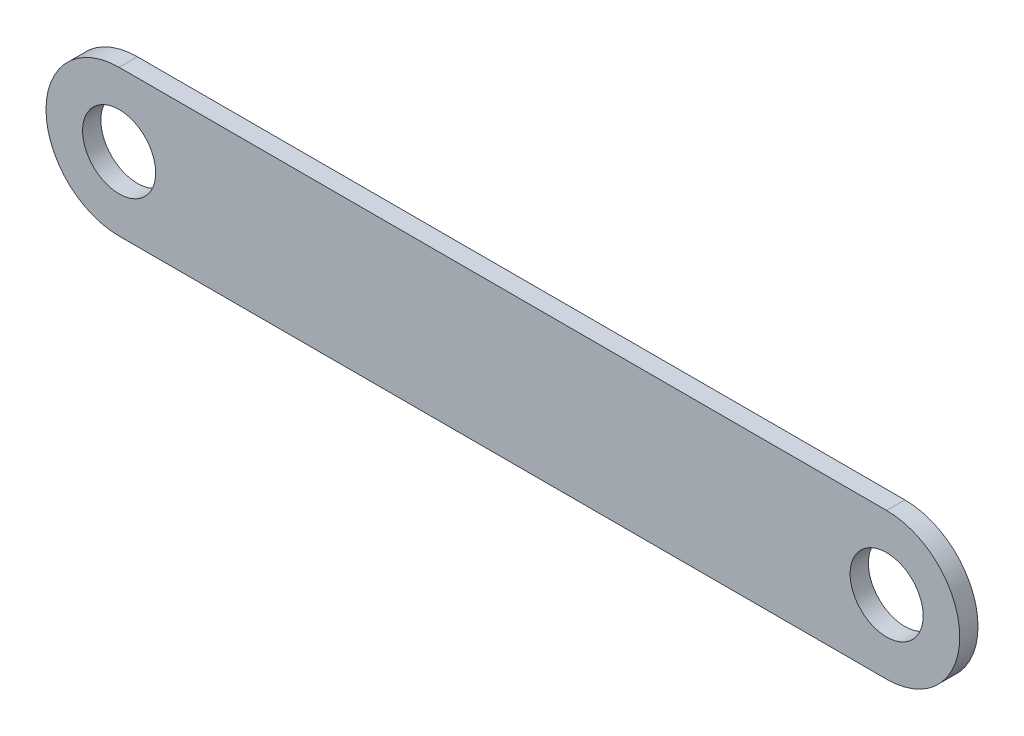
ISO-10303-21;
HEADER;
FILE_DESCRIPTION(('STEP AP214'),'2;1');
FILE_NAME('part.step','',(''),(''),'','','');
FILE_SCHEMA(('AUTOMOTIVE_DESIGN { 1 0 10303 214 1 1 1 1 }'));
ENDSEC;
DATA;
#1=APPLICATION_CONTEXT('core data for automotive mechanical design processes');
#2=APPLICATION_PROTOCOL_DEFINITION('international standard','automotive_design',2000,#1);
#3=PRODUCT_CONTEXT('',#1,'mechanical');
#4=PRODUCT('Part','Part','',(#3));
#5=PRODUCT_RELATED_PRODUCT_CATEGORY('part','',(#4));
#6=PRODUCT_DEFINITION_FORMATION('','',#4);
#7=PRODUCT_DEFINITION_CONTEXT('part definition',#1,'design');
#8=PRODUCT_DEFINITION('design','',#6,#7);
#9=PRODUCT_DEFINITION_SHAPE('','',#8);
#10=(LENGTH_UNIT() NAMED_UNIT(*) SI_UNIT(.MILLI.,.METRE.));
#11=(NAMED_UNIT(*) PLANE_ANGLE_UNIT() SI_UNIT($,.RADIAN.));
#12=(NAMED_UNIT(*) SI_UNIT($,.STERADIAN.) SOLID_ANGLE_UNIT());
#13=UNCERTAINTY_MEASURE_WITH_UNIT(LENGTH_MEASURE(1.E-05),#10,'distance_accuracy_value','');
#14=(GEOMETRIC_REPRESENTATION_CONTEXT(3) GLOBAL_UNCERTAINTY_ASSIGNED_CONTEXT((#13)) GLOBAL_UNIT_ASSIGNED_CONTEXT((#10,
#11,#12)) REPRESENTATION_CONTEXT('',''));
#15=CARTESIAN_POINT('',(0.,0.,0.));
#16=DIRECTION('',(0.,0.,1.));
#17=DIRECTION('',(1.,0.,0.));
#18=AXIS2_PLACEMENT_3D('',#15,#16,#17);
#19=CARTESIAN_POINT('',(51.5130500758725,1.55705614567526,5.));
#20=DIRECTION('',(0.,0.,-1.));
#21=DIRECTION('',(-1.,0.,0.));
#22=AXIS2_PLACEMENT_3D('',#19,#20,#21);
#23=CYLINDRICAL_SURFACE('',#22,20.);
#24=CARTESIAN_POINT('',(51.5130500758725,1.55705614567526,0.));
#25=DIRECTION('',(0.,0.,1.));
#26=DIRECTION('',(1.,0.,0.));
#27=AXIS2_PLACEMENT_3D('',#24,#25,#26);
#28=CIRCLE('',#27,20.);
#29=CARTESIAN_POINT('',(51.5130500758725,-18.4429438543247,0.));
#30=VERTEX_POINT('',#29);
#31=CARTESIAN_POINT('',(51.5130500758725,21.5570561456753,0.));
#32=VERTEX_POINT('',#31);
#33=EDGE_CURVE('E97',#30,#32,#28,.T.);
#34=ORIENTED_EDGE('',*,*,#33,.T.);
#35=DIRECTION('',(0.,0.,-1.));
#36=VECTOR('',#35,1.);
#37=CARTESIAN_POINT('',(51.5130500758725,21.5570561456753,5.));
#38=LINE('',#37,#36);
#39=CARTESIAN_POINT('',(51.5130500758725,21.5570561456753,5.));
#40=VERTEX_POINT('',#39);
#41=EDGE_CURVE('E11',#40,#32,#38,.T.);
#42=ORIENTED_EDGE('',*,*,#41,.F.);
#43=CARTESIAN_POINT('',(51.5130500758725,1.55705614567526,5.));
#44=DIRECTION('',(0.,0.,1.));
#45=DIRECTION('',(1.,0.,0.));
#46=AXIS2_PLACEMENT_3D('',#43,#44,#45);
#47=CIRCLE('',#46,20.);
#48=CARTESIAN_POINT('',(51.5130500758725,-18.4429438543247,5.));
#49=VERTEX_POINT('',#48);
#50=EDGE_CURVE('E85',#49,#40,#47,.T.);
#51=ORIENTED_EDGE('',*,*,#50,.F.);
#52=DIRECTION('',(0.,0.,-1.));
#53=VECTOR('',#52,1.);
#54=CARTESIAN_POINT('',(51.5130500758725,-18.4429438543247,5.));
#55=LINE('',#54,#53);
#56=EDGE_CURVE('E93',#49,#30,#55,.T.);
#57=ORIENTED_EDGE('',*,*,#56,.T.);
#58=EDGE_LOOP('',(#34,#42,#51,#57));
#59=FACE_BOUND('',#58,.T.);
#60=ADVANCED_FACE('F34',(#59),#23,.T.);
#61=CARTESIAN_POINT('',(51.5130500758725,21.5570561456753,5.));
#62=DIRECTION('',(0.,-1.,0.));
#63=DIRECTION('',(1.,0.,0.));
#64=AXIS2_PLACEMENT_3D('',#61,#62,#63);
#65=PLANE('',#64);
#66=DIRECTION('',(-1.,0.,0.));
#67=VECTOR('',#66,1.);
#68=CARTESIAN_POINT('',(51.5130500758725,21.5570561456753,0.));
#69=LINE('',#68,#67);
#70=CARTESIAN_POINT('',(-158.486949924127,21.5570561456752,0.));
#71=VERTEX_POINT('',#70);
#72=EDGE_CURVE('E89',#32,#71,#69,.T.);
#73=ORIENTED_EDGE('',*,*,#72,.T.);
#74=DIRECTION('',(0.,0.,-1.));
#75=VECTOR('',#74,1.);
#76=CARTESIAN_POINT('',(-158.486949924127,21.5570561456752,5.));
#77=LINE('',#76,#75);
#78=CARTESIAN_POINT('',(-158.486949924127,21.5570561456752,5.));
#79=VERTEX_POINT('',#78);
#80=EDGE_CURVE('E42',#79,#71,#77,.T.);
#81=ORIENTED_EDGE('',*,*,#80,.F.);
#82=DIRECTION('',(-1.,0.,0.));
#83=VECTOR('',#82,1.);
#84=CARTESIAN_POINT('',(51.5130500758725,21.5570561456753,5.));
#85=LINE('',#84,#83);
#86=EDGE_CURVE('E80',#40,#79,#85,.T.);
#87=ORIENTED_EDGE('',*,*,#86,.F.);
#88=ORIENTED_EDGE('',*,*,#41,.T.);
#89=EDGE_LOOP('',(#73,#81,#87,#88));
#90=FACE_BOUND('',#89,.T.);
#91=ADVANCED_FACE('F88',(#90),#65,.F.);
#92=CARTESIAN_POINT('',(-158.486949924127,1.55705614567525,5.));
#93=DIRECTION('',(0.,0.,-1.));
#94=DIRECTION('',(-1.,0.,0.));
#95=AXIS2_PLACEMENT_3D('',#92,#93,#94);
#96=CYLINDRICAL_SURFACE('',#95,20.);
#97=CARTESIAN_POINT('',(-158.486949924127,1.55705614567525,0.));
#98=DIRECTION('',(0.,0.,1.));
#99=DIRECTION('',(1.,0.,0.));
#100=AXIS2_PLACEMENT_3D('',#97,#98,#99);
#101=CIRCLE('',#100,20.);
#102=CARTESIAN_POINT('',(-158.486949924127,-18.4429438543247,0.));
#103=VERTEX_POINT('',#102);
#104=EDGE_CURVE('E67',#71,#103,#101,.T.);
#105=ORIENTED_EDGE('',*,*,#104,.T.);
#106=DIRECTION('',(0.,0.,-1.));
#107=VECTOR('',#106,1.);
#108=CARTESIAN_POINT('',(-158.486949924127,-18.4429438543247,5.));
#109=LINE('',#108,#107);
#110=CARTESIAN_POINT('',(-158.486949924127,-18.4429438543247,5.));
#111=VERTEX_POINT('',#110);
#112=EDGE_CURVE('E90',#111,#103,#109,.T.);
#113=ORIENTED_EDGE('',*,*,#112,.F.);
#114=CARTESIAN_POINT('',(-158.486949924127,1.55705614567525,5.));
#115=DIRECTION('',(0.,0.,1.));
#116=DIRECTION('',(1.,0.,0.));
#117=AXIS2_PLACEMENT_3D('',#114,#115,#116);
#118=CIRCLE('',#117,20.);
#119=EDGE_CURVE('E83',#79,#111,#118,.T.);
#120=ORIENTED_EDGE('',*,*,#119,.F.);
#121=ORIENTED_EDGE('',*,*,#80,.T.);
#122=EDGE_LOOP('',(#105,#113,#120,#121));
#123=FACE_BOUND('',#122,.T.);
#124=ADVANCED_FACE('F91',(#123),#96,.T.);
#125=CARTESIAN_POINT('',(-158.486949924127,-18.4429438543247,5.));
#126=DIRECTION('',(0.,1.,0.));
#127=DIRECTION('',(0.,0.,1.));
#128=AXIS2_PLACEMENT_3D('',#125,#126,#127);
#129=PLANE('',#128);
#130=DIRECTION('',(1.,0.,0.));
#131=VECTOR('',#130,1.);
#132=CARTESIAN_POINT('',(-158.486949924127,-18.4429438543247,0.));
#133=LINE('',#132,#131);
#134=EDGE_CURVE('E73',#103,#30,#133,.T.);
#135=ORIENTED_EDGE('',*,*,#134,.T.);
#136=ORIENTED_EDGE('',*,*,#56,.F.);
#137=DIRECTION('',(1.,0.,0.));
#138=VECTOR('',#137,1.);
#139=CARTESIAN_POINT('',(-158.486949924127,-18.4429438543247,5.));
#140=LINE('',#139,#138);
#141=EDGE_CURVE('E50',#111,#49,#140,.T.);
#142=ORIENTED_EDGE('',*,*,#141,.F.);
#143=ORIENTED_EDGE('',*,*,#112,.T.);
#144=EDGE_LOOP('',(#135,#136,#142,#143));
#145=FACE_BOUND('',#144,.T.);
#146=ADVANCED_FACE('F105',(#145),#129,.F.);
#147=CARTESIAN_POINT('',(51.5130500758725,1.55705614567526,5.));
#148=DIRECTION('',(0.,0.,1.));
#149=DIRECTION('',(1.,0.,0.));
#150=AXIS2_PLACEMENT_3D('',#147,#148,#149);
#151=PLANE('',#150);
#152=CARTESIAN_POINT('',(51.5130500758725,1.55705614567526,5.));
#153=DIRECTION('',(0.,0.,1.));
#154=DIRECTION('',(1.,0.,0.));
#155=AXIS2_PLACEMENT_3D('',#152,#153,#154);
#156=CIRCLE('',#155,10.);
#157=CARTESIAN_POINT('',(61.5130500758725,1.55705614567526,5.));
#158=VERTEX_POINT('',#157);
#159=EDGE_CURVE('E117',#158,#158,#156,.T.);
#160=ORIENTED_EDGE('',*,*,#159,.F.);
#161=EDGE_LOOP('',(#160));
#162=FACE_BOUND('',#161,.T.);
#163=CARTESIAN_POINT('',(-158.486949924127,1.55705614567525,5.));
#164=DIRECTION('',(0.,0.,1.));
#165=DIRECTION('',(1.,0.,0.));
#166=AXIS2_PLACEMENT_3D('',#163,#164,#165);
#167=CIRCLE('',#166,10.);
#168=CARTESIAN_POINT('',(-148.486949924127,1.55705614567525,5.));
#169=VERTEX_POINT('',#168);
#170=EDGE_CURVE('E111',#169,#169,#167,.T.);
#171=ORIENTED_EDGE('',*,*,#170,.F.);
#172=EDGE_LOOP('',(#171));
#173=FACE_BOUND('',#172,.T.);
#174=ORIENTED_EDGE('',*,*,#50,.T.);
#175=ORIENTED_EDGE('',*,*,#86,.T.);
#176=ORIENTED_EDGE('',*,*,#119,.T.);
#177=ORIENTED_EDGE('',*,*,#141,.T.);
#178=EDGE_LOOP('',(#174,#175,#176,#177));
#179=FACE_BOUND('',#178,.T.);
#180=ADVANCED_FACE('F81',(#162,#173,#179),#151,.T.);
#181=CARTESIAN_POINT('',(51.5130500758725,1.55705614567526,0.));
#182=DIRECTION('',(0.,0.,1.));
#183=DIRECTION('',(1.,0.,0.));
#184=AXIS2_PLACEMENT_3D('',#181,#182,#183);
#185=PLANE('',#184);
#186=CARTESIAN_POINT('',(51.5130500758725,1.55705614567526,0.));
#187=DIRECTION('',(0.,0.,1.));
#188=DIRECTION('',(1.,0.,0.));
#189=AXIS2_PLACEMENT_3D('',#186,#187,#188);
#190=CIRCLE('',#189,10.);
#191=CARTESIAN_POINT('',(61.5130500758725,1.55705614567526,0.));
#192=VERTEX_POINT('',#191);
#193=EDGE_CURVE('E114',#192,#192,#190,.T.);
#194=ORIENTED_EDGE('',*,*,#193,.T.);
#195=EDGE_LOOP('',(#194));
#196=FACE_BOUND('',#195,.T.);
#197=CARTESIAN_POINT('',(-158.486949924127,1.55705614567525,0.));
#198=DIRECTION('',(0.,0.,1.));
#199=DIRECTION('',(1.,0.,0.));
#200=AXIS2_PLACEMENT_3D('',#197,#198,#199);
#201=CIRCLE('',#200,10.);
#202=CARTESIAN_POINT('',(-148.486949924127,1.55705614567525,0.));
#203=VERTEX_POINT('',#202);
#204=EDGE_CURVE('E100',#203,#203,#201,.T.);
#205=ORIENTED_EDGE('',*,*,#204,.T.);
#206=EDGE_LOOP('',(#205));
#207=FACE_BOUND('',#206,.T.);
#208=ORIENTED_EDGE('',*,*,#33,.F.);
#209=ORIENTED_EDGE('',*,*,#134,.F.);
#210=ORIENTED_EDGE('',*,*,#104,.F.);
#211=ORIENTED_EDGE('',*,*,#72,.F.);
#212=EDGE_LOOP('',(#208,#209,#210,#211));
#213=FACE_BOUND('',#212,.T.);
#214=ADVANCED_FACE('F108',(#196,#207,#213),#185,.F.);
#215=CARTESIAN_POINT('',(-158.486949924127,1.55705614567525,0.));
#216=DIRECTION('',(0.,0.,1.));
#217=DIRECTION('',(1.,0.,0.));
#218=AXIS2_PLACEMENT_3D('',#215,#216,#217);
#219=CYLINDRICAL_SURFACE('',#218,10.);
#220=ORIENTED_EDGE('',*,*,#204,.F.);
#221=EDGE_LOOP('',(#220));
#222=FACE_BOUND('',#221,.T.);
#223=ORIENTED_EDGE('',*,*,#170,.T.);
#224=EDGE_LOOP('',(#223));
#225=FACE_BOUND('',#224,.T.);
#226=ADVANCED_FACE('F128',(#222,#225),#219,.F.);
#227=CARTESIAN_POINT('',(51.5130500758725,1.55705614567526,0.));
#228=DIRECTION('',(0.,0.,1.));
#229=DIRECTION('',(1.,0.,0.));
#230=AXIS2_PLACEMENT_3D('',#227,#228,#229);
#231=CYLINDRICAL_SURFACE('',#230,10.);
#232=ORIENTED_EDGE('',*,*,#193,.F.);
#233=EDGE_LOOP('',(#232));
#234=FACE_BOUND('',#233,.T.);
#235=ORIENTED_EDGE('',*,*,#159,.T.);
#236=EDGE_LOOP('',(#235));
#237=FACE_BOUND('',#236,.T.);
#238=ADVANCED_FACE('F125',(#234,#237),#231,.F.);
#239=CLOSED_SHELL('',(#60,#91,#124,#146,#180,#214,#226,#238));
#240=MANIFOLD_SOLID_BREP('B2',#239);
#241=ADVANCED_BREP_SHAPE_REPRESENTATION('',(#18,#240),#14);
#242=SHAPE_DEFINITION_REPRESENTATION(#9,#241);
ENDSEC;
END-ISO-10303-21;
